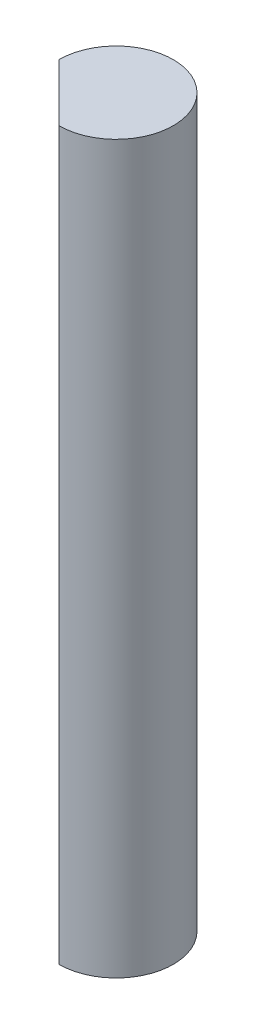
ISO-10303-21;
HEADER;
FILE_DESCRIPTION(('STEP AP214'),'2;1');
FILE_NAME('part.step','',(''),(''),'','','');
FILE_SCHEMA(('AUTOMOTIVE_DESIGN { 1 0 10303 214 1 1 1 1 }'));
ENDSEC;
DATA;
#1=APPLICATION_CONTEXT('core data for automotive mechanical design processes');
#2=APPLICATION_PROTOCOL_DEFINITION('international standard','automotive_design',2000,#1);
#3=PRODUCT_CONTEXT('',#1,'mechanical');
#4=PRODUCT('Part','Part','',(#3));
#5=PRODUCT_RELATED_PRODUCT_CATEGORY('part','',(#4));
#6=PRODUCT_DEFINITION_FORMATION('','',#4);
#7=PRODUCT_DEFINITION_CONTEXT('part definition',#1,'design');
#8=PRODUCT_DEFINITION('design','',#6,#7);
#9=PRODUCT_DEFINITION_SHAPE('','',#8);
#10=(LENGTH_UNIT() NAMED_UNIT(*) SI_UNIT(.MILLI.,.METRE.));
#11=(NAMED_UNIT(*) PLANE_ANGLE_UNIT() SI_UNIT($,.RADIAN.));
#12=(NAMED_UNIT(*) SI_UNIT($,.STERADIAN.) SOLID_ANGLE_UNIT());
#13=UNCERTAINTY_MEASURE_WITH_UNIT(LENGTH_MEASURE(1.E-05),#10,'distance_accuracy_value','');
#14=(GEOMETRIC_REPRESENTATION_CONTEXT(3) GLOBAL_UNCERTAINTY_ASSIGNED_CONTEXT((#13)) GLOBAL_UNIT_ASSIGNED_CONTEXT((#10,
#11,#12)) REPRESENTATION_CONTEXT('',''));
#15=CARTESIAN_POINT('',(0.,0.,0.));
#16=DIRECTION('',(0.,0.,1.));
#17=DIRECTION('',(1.,0.,0.));
#18=AXIS2_PLACEMENT_3D('',#15,#16,#17);
#19=CARTESIAN_POINT('',(0.,50.8,0.));
#20=DIRECTION('',(0.,-1.,0.));
#21=DIRECTION('',(0.,0.,-1.));
#22=AXIS2_PLACEMENT_3D('',#19,#20,#21);
#23=CYLINDRICAL_SURFACE('',#22,4.);
#24=CARTESIAN_POINT('',(0.,0.,0.));
#25=DIRECTION('',(0.,1.,0.));
#26=DIRECTION('',(0.,0.,1.));
#27=AXIS2_PLACEMENT_3D('',#24,#25,#26);
#28=CIRCLE('',#27,4.);
#29=CARTESIAN_POINT('',(0.,0.,4.));
#30=VERTEX_POINT('',#29);
#31=CARTESIAN_POINT('',(-4.,0.,0.));
#32=VERTEX_POINT('',#31);
#33=EDGE_CURVE('E68',#30,#32,#28,.T.);
#34=ORIENTED_EDGE('',*,*,#33,.T.);
#35=DIRECTION('',(0.,-1.,0.));
#36=VECTOR('',#35,1.);
#37=CARTESIAN_POINT('',(-4.,50.8,0.));
#38=LINE('',#37,#36);
#39=CARTESIAN_POINT('',(-4.,50.8,0.));
#40=VERTEX_POINT('',#39);
#41=EDGE_CURVE('E11',#40,#32,#38,.T.);
#42=ORIENTED_EDGE('',*,*,#41,.F.);
#43=CARTESIAN_POINT('',(0.,50.8,0.));
#44=DIRECTION('',(0.,1.,0.));
#45=DIRECTION('',(0.,0.,1.));
#46=AXIS2_PLACEMENT_3D('',#43,#44,#45);
#47=CIRCLE('',#46,4.);
#48=CARTESIAN_POINT('',(0.,50.8,4.));
#49=VERTEX_POINT('',#48);
#50=EDGE_CURVE('E67',#49,#40,#47,.T.);
#51=ORIENTED_EDGE('',*,*,#50,.F.);
#52=DIRECTION('',(0.,-1.,0.));
#53=VECTOR('',#52,1.);
#54=CARTESIAN_POINT('',(0.,50.8,4.));
#55=LINE('',#54,#53);
#56=EDGE_CURVE('E45',#49,#30,#55,.T.);
#57=ORIENTED_EDGE('',*,*,#56,.T.);
#58=EDGE_LOOP('',(#34,#42,#51,#57));
#59=FACE_BOUND('',#58,.T.);
#60=ADVANCED_FACE('F37',(#59),#23,.T.);
#61=CARTESIAN_POINT('',(-4.,50.8,0.));
#62=DIRECTION('',(0.707106781186548,0.,-0.707106781186548));
#63=DIRECTION('',(-0.707106781186548,0.,-0.707106781186548));
#64=AXIS2_PLACEMENT_3D('',#61,#62,#63);
#65=PLANE('',#64);
#66=DIRECTION('',(0.707106781186548,0.,0.707106781186548));
#67=VECTOR('',#66,1.);
#68=CARTESIAN_POINT('',(-4.,0.,0.));
#69=LINE('',#68,#67);
#70=EDGE_CURVE('E60',#32,#30,#69,.T.);
#71=ORIENTED_EDGE('',*,*,#70,.T.);
#72=ORIENTED_EDGE('',*,*,#56,.F.);
#73=DIRECTION('',(0.707106781186548,0.,0.707106781186548));
#74=VECTOR('',#73,1.);
#75=CARTESIAN_POINT('',(-4.,50.8,0.));
#76=LINE('',#75,#74);
#77=EDGE_CURVE('E52',#40,#49,#76,.T.);
#78=ORIENTED_EDGE('',*,*,#77,.F.);
#79=ORIENTED_EDGE('',*,*,#41,.T.);
#80=EDGE_LOOP('',(#71,#72,#78,#79));
#81=FACE_BOUND('',#80,.T.);
#82=ADVANCED_FACE('F63',(#81),#65,.F.);
#83=CARTESIAN_POINT('',(0.,50.8,0.));
#84=DIRECTION('',(0.,1.,0.));
#85=DIRECTION('',(0.,0.,1.));
#86=AXIS2_PLACEMENT_3D('',#83,#84,#85);
#87=PLANE('',#86);
#88=ORIENTED_EDGE('',*,*,#50,.T.);
#89=ORIENTED_EDGE('',*,*,#77,.T.);
#90=EDGE_LOOP('',(#88,#89));
#91=FACE_BOUND('',#90,.T.);
#92=ADVANCED_FACE('F75',(#91),#87,.T.);
#93=CARTESIAN_POINT('',(0.,0.,0.));
#94=DIRECTION('',(0.,1.,0.));
#95=DIRECTION('',(0.,0.,1.));
#96=AXIS2_PLACEMENT_3D('',#93,#94,#95);
#97=PLANE('',#96);
#98=ORIENTED_EDGE('',*,*,#33,.F.);
#99=ORIENTED_EDGE('',*,*,#70,.F.);
#100=EDGE_LOOP('',(#98,#99));
#101=FACE_BOUND('',#100,.T.);
#102=ADVANCED_FACE('F71',(#101),#97,.F.);
#103=CLOSED_SHELL('',(#60,#82,#92,#102));
#104=MANIFOLD_SOLID_BREP('B2',#103);
#105=ADVANCED_BREP_SHAPE_REPRESENTATION('',(#18,#104),#14);
#106=SHAPE_DEFINITION_REPRESENTATION(#9,#105);
ENDSEC;
END-ISO-10303-21;
